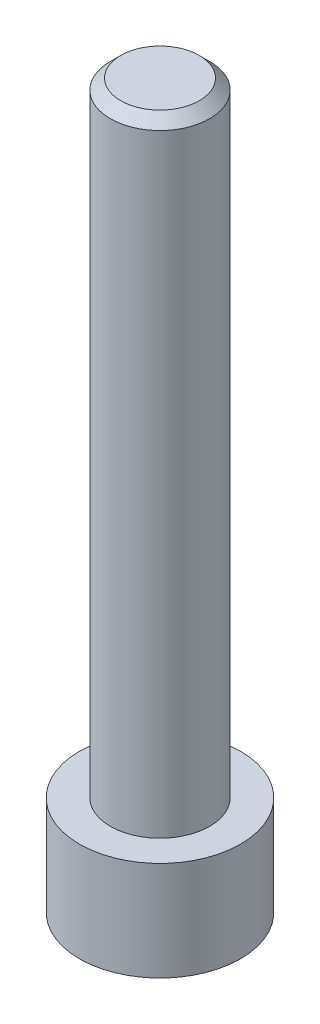
ISO-10303-21;
HEADER;
FILE_DESCRIPTION(('STEP AP214'),'2;1');
FILE_NAME('part.step','',(''),(''),'','','');
FILE_SCHEMA(('AUTOMOTIVE_DESIGN { 1 0 10303 214 1 1 1 1 }'));
ENDSEC;
DATA;
#1=APPLICATION_CONTEXT('core data for automotive mechanical design processes');
#2=APPLICATION_PROTOCOL_DEFINITION('international standard','automotive_design',2000,#1);
#3=PRODUCT_CONTEXT('',#1,'mechanical');
#4=PRODUCT('Part','Part','',(#3));
#5=PRODUCT_RELATED_PRODUCT_CATEGORY('part','',(#4));
#6=PRODUCT_DEFINITION_FORMATION('','',#4);
#7=PRODUCT_DEFINITION_CONTEXT('part definition',#1,'design');
#8=PRODUCT_DEFINITION('design','',#6,#7);
#9=PRODUCT_DEFINITION_SHAPE('','',#8);
#10=(LENGTH_UNIT() NAMED_UNIT(*) SI_UNIT(.MILLI.,.METRE.));
#11=(NAMED_UNIT(*) PLANE_ANGLE_UNIT() SI_UNIT($,.RADIAN.));
#12=(NAMED_UNIT(*) SI_UNIT($,.STERADIAN.) SOLID_ANGLE_UNIT());
#13=UNCERTAINTY_MEASURE_WITH_UNIT(LENGTH_MEASURE(1.E-05),#10,'distance_accuracy_value','');
#14=(GEOMETRIC_REPRESENTATION_CONTEXT(3) GLOBAL_UNCERTAINTY_ASSIGNED_CONTEXT((#13)) GLOBAL_UNIT_ASSIGNED_CONTEXT((#10,
#11,#12)) REPRESENTATION_CONTEXT('',''));
#15=CARTESIAN_POINT('',(0.,0.,0.));
#16=DIRECTION('',(0.,0.,1.));
#17=DIRECTION('',(1.,0.,0.));
#18=AXIS2_PLACEMENT_3D('',#15,#16,#17);
#19=CARTESIAN_POINT('',(0.,34.78,0.));
#20=DIRECTION('',(0.,-1.,0.));
#21=DIRECTION('',(0.,0.,-1.));
#22=AXIS2_PLACEMENT_3D('',#19,#20,#21);
#23=CYLINDRICAL_SURFACE('',#22,3.875);
#24=CARTESIAN_POINT('',(0.,0.,0.));
#25=DIRECTION('',(0.,1.,0.));
#26=DIRECTION('',(0.,0.,1.));
#27=AXIS2_PLACEMENT_3D('',#24,#25,#26);
#28=CIRCLE('',#27,3.875);
#29=CARTESIAN_POINT('',(0.,0.,3.875));
#30=VERTEX_POINT('',#29);
#31=EDGE_CURVE('E145',#30,#30,#28,.T.);
#32=ORIENTED_EDGE('',*,*,#31,.T.);
#33=EDGE_LOOP('',(#32));
#34=FACE_BOUND('',#33,.T.);
#35=CARTESIAN_POINT('',(0.,4.78,0.));
#36=DIRECTION('',(0.,1.,0.));
#37=DIRECTION('',(0.,0.,1.));
#38=AXIS2_PLACEMENT_3D('',#35,#36,#37);
#39=CIRCLE('',#38,3.875);
#40=CARTESIAN_POINT('',(0.,4.78,3.875));
#41=VERTEX_POINT('',#40);
#42=EDGE_CURVE('E144',#41,#41,#39,.T.);
#43=ORIENTED_EDGE('',*,*,#42,.F.);
#44=EDGE_LOOP('',(#43));
#45=FACE_BOUND('',#44,.T.);
#46=ADVANCED_FACE('F34',(#34,#45),#23,.T.);
#47=CARTESIAN_POINT('',(0.,0.,0.));
#48=DIRECTION('',(0.,1.,0.));
#49=DIRECTION('',(0.,0.,1.));
#50=AXIS2_PLACEMENT_3D('',#47,#48,#49);
#51=PLANE('',#50);
#52=DIRECTION('',(-0.5,0.,0.866025403784439));
#53=VECTOR('',#52,1.);
#54=CARTESIAN_POINT('',(2.64426423288849,0.,0.));
#55=LINE('',#54,#53);
#56=CARTESIAN_POINT('',(2.64426423288849,0.,0.));
#57=VERTEX_POINT('',#56);
#58=CARTESIAN_POINT('',(1.32213211644424,0.,2.29));
#59=VERTEX_POINT('',#58);
#60=EDGE_CURVE('E123',#57,#59,#55,.T.);
#61=ORIENTED_EDGE('',*,*,#60,.F.);
#62=DIRECTION('',(0.5,0.,0.866025403784439));
#63=VECTOR('',#62,1.);
#64=CARTESIAN_POINT('',(1.32213211644424,0.,-2.29));
#65=LINE('',#64,#63);
#66=CARTESIAN_POINT('',(1.32213211644424,0.,-2.29));
#67=VERTEX_POINT('',#66);
#68=EDGE_CURVE('E49',#67,#57,#65,.T.);
#69=ORIENTED_EDGE('',*,*,#68,.F.);
#70=DIRECTION('',(1.,0.,0.));
#71=VECTOR('',#70,1.);
#72=CARTESIAN_POINT('',(-1.32213211644424,0.,-2.29));
#73=LINE('',#72,#71);
#74=CARTESIAN_POINT('',(-1.32213211644424,0.,-2.29));
#75=VERTEX_POINT('',#74);
#76=EDGE_CURVE('E132',#75,#67,#73,.T.);
#77=ORIENTED_EDGE('',*,*,#76,.F.);
#78=DIRECTION('',(0.5,0.,-0.866025403784439));
#79=VECTOR('',#78,1.);
#80=CARTESIAN_POINT('',(-2.64426423288849,0.,0.));
#81=LINE('',#80,#79);
#82=CARTESIAN_POINT('',(-2.64426423288849,0.,0.));
#83=VERTEX_POINT('',#82);
#84=EDGE_CURVE('E130',#83,#75,#81,.T.);
#85=ORIENTED_EDGE('',*,*,#84,.F.);
#86=DIRECTION('',(-0.5,0.,-0.866025403784439));
#87=VECTOR('',#86,1.);
#88=CARTESIAN_POINT('',(-1.32213211644424,0.,2.29));
#89=LINE('',#88,#87);
#90=CARTESIAN_POINT('',(-1.32213211644424,0.,2.29));
#91=VERTEX_POINT('',#90);
#92=EDGE_CURVE('E97',#91,#83,#89,.T.);
#93=ORIENTED_EDGE('',*,*,#92,.F.);
#94=DIRECTION('',(-1.,0.,0.));
#95=VECTOR('',#94,1.);
#96=CARTESIAN_POINT('',(1.32213211644424,0.,2.29));
#97=LINE('',#96,#95);
#98=EDGE_CURVE('E126',#59,#91,#97,.T.);
#99=ORIENTED_EDGE('',*,*,#98,.F.);
#100=EDGE_LOOP('',(#61,#69,#77,#85,#93,#99));
#101=FACE_BOUND('',#100,.T.);
#102=ORIENTED_EDGE('',*,*,#31,.F.);
#103=EDGE_LOOP('',(#102));
#104=FACE_BOUND('',#103,.T.);
#105=ADVANCED_FACE('F167',(#101,#104),#51,.F.);
#106=CARTESIAN_POINT('',(0.,4.78,0.));
#107=DIRECTION('',(0.,1.,0.));
#108=DIRECTION('',(0.,0.,1.));
#109=AXIS2_PLACEMENT_3D('',#106,#107,#108);
#110=PLANE('',#109);
#111=CARTESIAN_POINT('',(0.,4.78,0.));
#112=DIRECTION('',(0.,1.,0.));
#113=DIRECTION('',(0.,0.,1.));
#114=AXIS2_PLACEMENT_3D('',#111,#112,#113);
#115=CIRCLE('',#114,2.39);
#116=CARTESIAN_POINT('',(0.,4.78,2.39));
#117=VERTEX_POINT('',#116);
#118=EDGE_CURVE('E136',#117,#117,#115,.T.);
#119=ORIENTED_EDGE('',*,*,#118,.F.);
#120=EDGE_LOOP('',(#119));
#121=FACE_BOUND('',#120,.T.);
#122=ORIENTED_EDGE('',*,*,#42,.T.);
#123=EDGE_LOOP('',(#122));
#124=FACE_BOUND('',#123,.T.);
#125=ADVANCED_FACE('F172',(#121,#124),#110,.T.);
#126=CARTESIAN_POINT('',(0.,4.78,0.));
#127=DIRECTION('',(0.,1.,0.));
#128=DIRECTION('',(0.,0.,1.));
#129=AXIS2_PLACEMENT_3D('',#126,#127,#128);
#130=CYLINDRICAL_SURFACE('',#129,2.39);
#131=CARTESIAN_POINT('',(0.,34.28,0.));
#132=DIRECTION('',(0.,1.,0.));
#133=DIRECTION('',(0.,0.,1.));
#134=AXIS2_PLACEMENT_3D('',#131,#132,#133);
#135=CIRCLE('',#134,2.39);
#136=CARTESIAN_POINT('',(0.,34.28,2.39));
#137=VERTEX_POINT('',#136);
#138=EDGE_CURVE('E12',#137,#137,#135,.F.);
#139=ORIENTED_EDGE('',*,*,#138,.T.);
#140=EDGE_LOOP('',(#139));
#141=FACE_BOUND('',#140,.T.);
#142=ORIENTED_EDGE('',*,*,#118,.T.);
#143=EDGE_LOOP('',(#142));
#144=FACE_BOUND('',#143,.T.);
#145=ADVANCED_FACE('F163',(#141,#144),#130,.T.);
#146=CARTESIAN_POINT('',(0.,34.78,0.));
#147=DIRECTION('',(0.,1.,0.));
#148=DIRECTION('',(0.,0.,1.));
#149=AXIS2_PLACEMENT_3D('',#146,#147,#148);
#150=PLANE('',#149);
#151=CARTESIAN_POINT('',(0.,34.78,0.));
#152=DIRECTION('',(0.,1.,0.));
#153=DIRECTION('',(0.,0.,1.));
#154=AXIS2_PLACEMENT_3D('',#151,#152,#153);
#155=CIRCLE('',#154,1.89);
#156=CARTESIAN_POINT('',(0.,34.78,1.89));
#157=VERTEX_POINT('',#156);
#158=EDGE_CURVE('E42',#157,#157,#155,.T.);
#159=ORIENTED_EDGE('',*,*,#158,.T.);
#160=EDGE_LOOP('',(#159));
#161=FACE_BOUND('',#160,.T.);
#162=ADVANCED_FACE('F152',(#161),#150,.T.);
#163=CARTESIAN_POINT('',(0.,34.78,0.));
#164=DIRECTION('',(0.,-1.,0.));
#165=DIRECTION('',(0.,0.,-1.));
#166=AXIS2_PLACEMENT_3D('',#163,#164,#165);
#167=CONICAL_SURFACE('',#166,1.89,0.785398163397452);
#168=ORIENTED_EDGE('',*,*,#138,.F.);
#169=EDGE_LOOP('',(#168));
#170=FACE_BOUND('',#169,.T.);
#171=ORIENTED_EDGE('',*,*,#158,.F.);
#172=EDGE_LOOP('',(#171));
#173=FACE_BOUND('',#172,.T.);
#174=ADVANCED_FACE('F36',(#170,#173),#167,.T.);
#175=CARTESIAN_POINT('',(1.32213211644424,3.36,-2.29));
#176=DIRECTION('',(0.866025403784439,0.,-0.5));
#177=DIRECTION('',(-0.5,0.,-0.866025403784439));
#178=AXIS2_PLACEMENT_3D('',#175,#176,#177);
#179=PLANE('',#178);
#180=ORIENTED_EDGE('',*,*,#68,.T.);
#181=DIRECTION('',(0.,-1.,0.));
#182=VECTOR('',#181,1.);
#183=CARTESIAN_POINT('',(2.64426423288849,3.36,0.));
#184=LINE('',#183,#182);
#185=CARTESIAN_POINT('',(2.64426423288849,3.36,0.));
#186=VERTEX_POINT('',#185);
#187=EDGE_CURVE('E79',#186,#57,#184,.T.);
#188=ORIENTED_EDGE('',*,*,#187,.F.);
#189=DIRECTION('',(0.5,0.,0.866025403784439));
#190=VECTOR('',#189,1.);
#191=CARTESIAN_POINT('',(1.32213211644424,3.36,-2.29));
#192=LINE('',#191,#190);
#193=CARTESIAN_POINT('',(1.32213211644424,3.36,-2.29));
#194=VERTEX_POINT('',#193);
#195=EDGE_CURVE('E134',#194,#186,#192,.T.);
#196=ORIENTED_EDGE('',*,*,#195,.F.);
#197=DIRECTION('',(0.,-1.,0.));
#198=VECTOR('',#197,1.);
#199=CARTESIAN_POINT('',(1.32213211644424,3.36,-2.29));
#200=LINE('',#199,#198);
#201=EDGE_CURVE('E57',#194,#67,#200,.T.);
#202=ORIENTED_EDGE('',*,*,#201,.T.);
#203=EDGE_LOOP('',(#180,#188,#196,#202));
#204=FACE_BOUND('',#203,.T.);
#205=ADVANCED_FACE('F155',(#204),#179,.F.);
#206=CARTESIAN_POINT('',(-1.32213211644424,3.36,-2.29));
#207=DIRECTION('',(0.,0.,-1.));
#208=DIRECTION('',(-1.,0.,0.));
#209=AXIS2_PLACEMENT_3D('',#206,#207,#208);
#210=PLANE('',#209);
#211=ORIENTED_EDGE('',*,*,#76,.T.);
#212=ORIENTED_EDGE('',*,*,#201,.F.);
#213=DIRECTION('',(1.,0.,0.));
#214=VECTOR('',#213,1.);
#215=CARTESIAN_POINT('',(-1.32213211644424,3.36,-2.29));
#216=LINE('',#215,#214);
#217=CARTESIAN_POINT('',(-1.32213211644424,3.36,-2.29));
#218=VERTEX_POINT('',#217);
#219=EDGE_CURVE('E109',#218,#194,#216,.T.);
#220=ORIENTED_EDGE('',*,*,#219,.F.);
#221=DIRECTION('',(0.,-1.,0.));
#222=VECTOR('',#221,1.);
#223=CARTESIAN_POINT('',(-1.32213211644424,3.36,-2.29));
#224=LINE('',#223,#222);
#225=EDGE_CURVE('E101',#218,#75,#224,.T.);
#226=ORIENTED_EDGE('',*,*,#225,.T.);
#227=EDGE_LOOP('',(#211,#212,#220,#226));
#228=FACE_BOUND('',#227,.T.);
#229=ADVANCED_FACE('F161',(#228),#210,.F.);
#230=CARTESIAN_POINT('',(-2.64426423288849,3.36,0.));
#231=DIRECTION('',(-0.866025403784438,0.,-0.5));
#232=DIRECTION('',(-0.5,0.,0.866025403784439));
#233=AXIS2_PLACEMENT_3D('',#230,#231,#232);
#234=PLANE('',#233);
#235=ORIENTED_EDGE('',*,*,#84,.T.);
#236=ORIENTED_EDGE('',*,*,#225,.F.);
#237=DIRECTION('',(0.5,0.,-0.866025403784439));
#238=VECTOR('',#237,1.);
#239=CARTESIAN_POINT('',(-2.64426423288849,3.36,0.));
#240=LINE('',#239,#238);
#241=CARTESIAN_POINT('',(-2.64426423288849,3.36,0.));
#242=VERTEX_POINT('',#241);
#243=EDGE_CURVE('E105',#242,#218,#240,.T.);
#244=ORIENTED_EDGE('',*,*,#243,.F.);
#245=DIRECTION('',(0.,-1.,0.));
#246=VECTOR('',#245,1.);
#247=CARTESIAN_POINT('',(-2.64426423288849,3.36,0.));
#248=LINE('',#247,#246);
#249=EDGE_CURVE('E90',#242,#83,#248,.T.);
#250=ORIENTED_EDGE('',*,*,#249,.T.);
#251=EDGE_LOOP('',(#235,#236,#244,#250));
#252=FACE_BOUND('',#251,.T.);
#253=ADVANCED_FACE('F106',(#252),#234,.F.);
#254=CARTESIAN_POINT('',(-1.32213211644424,3.36,2.29));
#255=DIRECTION('',(-0.866025403784439,0.,0.5));
#256=DIRECTION('',(0.5,0.,0.866025403784439));
#257=AXIS2_PLACEMENT_3D('',#254,#255,#256);
#258=PLANE('',#257);
#259=ORIENTED_EDGE('',*,*,#92,.T.);
#260=ORIENTED_EDGE('',*,*,#249,.F.);
#261=DIRECTION('',(-0.5,0.,-0.866025403784439));
#262=VECTOR('',#261,1.);
#263=CARTESIAN_POINT('',(-1.32213211644424,3.36,2.29));
#264=LINE('',#263,#262);
#265=CARTESIAN_POINT('',(-1.32213211644424,3.36,2.29));
#266=VERTEX_POINT('',#265);
#267=EDGE_CURVE('E94',#266,#242,#264,.T.);
#268=ORIENTED_EDGE('',*,*,#267,.F.);
#269=DIRECTION('',(0.,-1.,0.));
#270=VECTOR('',#269,1.);
#271=CARTESIAN_POINT('',(-1.32213211644424,3.36,2.29));
#272=LINE('',#271,#270);
#273=EDGE_CURVE('E102',#266,#91,#272,.T.);
#274=ORIENTED_EDGE('',*,*,#273,.T.);
#275=EDGE_LOOP('',(#259,#260,#268,#274));
#276=FACE_BOUND('',#275,.T.);
#277=ADVANCED_FACE('F92',(#276),#258,.F.);
#278=CARTESIAN_POINT('',(1.32213211644424,3.36,2.29));
#279=DIRECTION('',(0.,0.,1.));
#280=DIRECTION('',(1.,0.,0.));
#281=AXIS2_PLACEMENT_3D('',#278,#279,#280);
#282=PLANE('',#281);
#283=ORIENTED_EDGE('',*,*,#98,.T.);
#284=ORIENTED_EDGE('',*,*,#273,.F.);
#285=DIRECTION('',(-1.,0.,0.));
#286=VECTOR('',#285,1.);
#287=CARTESIAN_POINT('',(1.32213211644424,3.36,2.29));
#288=LINE('',#287,#286);
#289=CARTESIAN_POINT('',(1.32213211644424,3.36,2.29));
#290=VERTEX_POINT('',#289);
#291=EDGE_CURVE('E115',#290,#266,#288,.T.);
#292=ORIENTED_EDGE('',*,*,#291,.F.);
#293=DIRECTION('',(0.,-1.,0.));
#294=VECTOR('',#293,1.);
#295=CARTESIAN_POINT('',(1.32213211644424,3.36,2.29));
#296=LINE('',#295,#294);
#297=EDGE_CURVE('E139',#290,#59,#296,.T.);
#298=ORIENTED_EDGE('',*,*,#297,.T.);
#299=EDGE_LOOP('',(#283,#284,#292,#298));
#300=FACE_BOUND('',#299,.T.);
#301=ADVANCED_FACE('F186',(#300),#282,.F.);
#302=CARTESIAN_POINT('',(2.64426423288849,3.36,0.));
#303=DIRECTION('',(0.866025403784439,0.,0.5));
#304=DIRECTION('',(0.5,0.,-0.866025403784439));
#305=AXIS2_PLACEMENT_3D('',#302,#303,#304);
#306=PLANE('',#305);
#307=ORIENTED_EDGE('',*,*,#60,.T.);
#308=ORIENTED_EDGE('',*,*,#297,.F.);
#309=DIRECTION('',(-0.5,0.,0.866025403784439));
#310=VECTOR('',#309,1.);
#311=CARTESIAN_POINT('',(2.64426423288849,3.36,0.));
#312=LINE('',#311,#310);
#313=EDGE_CURVE('E117',#186,#290,#312,.T.);
#314=ORIENTED_EDGE('',*,*,#313,.F.);
#315=ORIENTED_EDGE('',*,*,#187,.T.);
#316=EDGE_LOOP('',(#307,#308,#314,#315));
#317=FACE_BOUND('',#316,.T.);
#318=ADVANCED_FACE('F183',(#317),#306,.F.);
#319=CARTESIAN_POINT('',(0.,3.36,0.));
#320=DIRECTION('',(0.,-1.,0.));
#321=DIRECTION('',(0.,0.,-1.));
#322=AXIS2_PLACEMENT_3D('',#319,#320,#321);
#323=PLANE('',#322);
#324=ORIENTED_EDGE('',*,*,#195,.T.);
#325=ORIENTED_EDGE('',*,*,#313,.T.);
#326=ORIENTED_EDGE('',*,*,#291,.T.);
#327=ORIENTED_EDGE('',*,*,#267,.T.);
#328=ORIENTED_EDGE('',*,*,#243,.T.);
#329=ORIENTED_EDGE('',*,*,#219,.T.);
#330=EDGE_LOOP('',(#324,#325,#326,#327,#328,#329));
#331=FACE_BOUND('',#330,.T.);
#332=ADVANCED_FACE('F112',(#331),#323,.T.);
#333=CLOSED_SHELL('',(#46,#105,#125,#145,#162,#174,#205,#229,#253,#277,#301,#318,#332));
#334=MANIFOLD_SOLID_BREP('B2',#333);
#335=ADVANCED_BREP_SHAPE_REPRESENTATION('',(#18,#334),#14);
#336=SHAPE_DEFINITION_REPRESENTATION(#9,#335);
ENDSEC;
END-ISO-10303-21;
